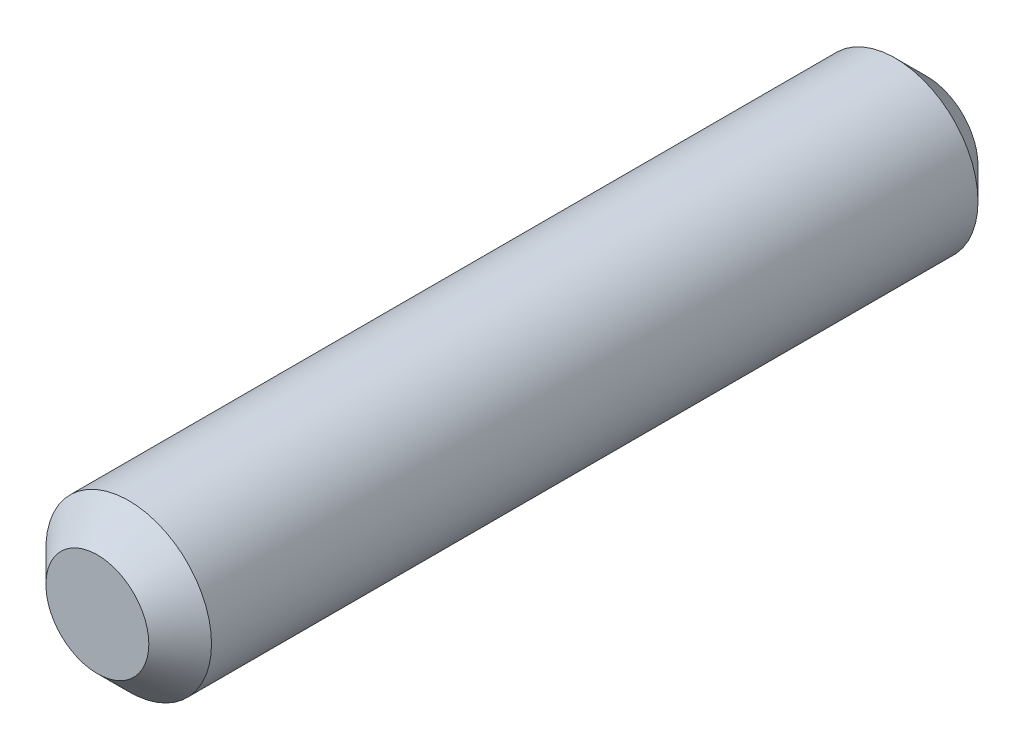
ISO-10303-21;
HEADER;
FILE_DESCRIPTION(('STEP AP214'),'2;1');
FILE_NAME('part.step','',(''),(''),'','','');
FILE_SCHEMA(('AUTOMOTIVE_DESIGN { 1 0 10303 214 1 1 1 1 }'));
ENDSEC;
DATA;
#1=APPLICATION_CONTEXT('core data for automotive mechanical design processes');
#2=APPLICATION_PROTOCOL_DEFINITION('international standard','automotive_design',2000,#1);
#3=PRODUCT_CONTEXT('',#1,'mechanical');
#4=PRODUCT('Part','Part','',(#3));
#5=PRODUCT_RELATED_PRODUCT_CATEGORY('part','',(#4));
#6=PRODUCT_DEFINITION_FORMATION('','',#4);
#7=PRODUCT_DEFINITION_CONTEXT('part definition',#1,'design');
#8=PRODUCT_DEFINITION('design','',#6,#7);
#9=PRODUCT_DEFINITION_SHAPE('','',#8);
#10=(LENGTH_UNIT() NAMED_UNIT(*) SI_UNIT(.MILLI.,.METRE.));
#11=(NAMED_UNIT(*) PLANE_ANGLE_UNIT() SI_UNIT($,.RADIAN.));
#12=(NAMED_UNIT(*) SI_UNIT($,.STERADIAN.) SOLID_ANGLE_UNIT());
#13=UNCERTAINTY_MEASURE_WITH_UNIT(LENGTH_MEASURE(1.E-05),#10,'distance_accuracy_value','');
#14=(GEOMETRIC_REPRESENTATION_CONTEXT(3) GLOBAL_UNCERTAINTY_ASSIGNED_CONTEXT((#13)) GLOBAL_UNIT_ASSIGNED_CONTEXT((#10,
#11,#12)) REPRESENTATION_CONTEXT('',''));
#15=CARTESIAN_POINT('',(0.,0.,0.));
#16=DIRECTION('',(0.,0.,1.));
#17=DIRECTION('',(1.,0.,0.));
#18=AXIS2_PLACEMENT_3D('',#15,#16,#17);
#19=CARTESIAN_POINT('',(0.,0.,7.935));
#20=DIRECTION('',(0.,0.,-1.));
#21=DIRECTION('',(-1.,0.,0.));
#22=AXIS2_PLACEMENT_3D('',#19,#20,#21);
#23=CYLINDRICAL_SURFACE('',#22,1.585);
#24=CARTESIAN_POINT('',(0.,0.,-7.335));
#25=DIRECTION('',(0.,0.,1.));
#26=DIRECTION('',(1.,0.,0.));
#27=AXIS2_PLACEMENT_3D('',#24,#25,#26);
#28=CIRCLE('',#27,1.585);
#29=CARTESIAN_POINT('',(1.585,0.,-7.335));
#30=VERTEX_POINT('',#29);
#31=EDGE_CURVE('E49',#30,#30,#28,.T.);
#32=ORIENTED_EDGE('',*,*,#31,.T.);
#33=EDGE_LOOP('',(#32));
#34=FACE_BOUND('',#33,.T.);
#35=CARTESIAN_POINT('',(0.,0.,7.335));
#36=DIRECTION('',(0.,0.,1.));
#37=DIRECTION('',(1.,0.,0.));
#38=AXIS2_PLACEMENT_3D('',#35,#36,#37);
#39=CIRCLE('',#38,1.585);
#40=CARTESIAN_POINT('',(1.585,0.,7.335));
#41=VERTEX_POINT('',#40);
#42=EDGE_CURVE('E53',#41,#41,#39,.F.);
#43=ORIENTED_EDGE('',*,*,#42,.T.);
#44=EDGE_LOOP('',(#43));
#45=FACE_BOUND('',#44,.T.);
#46=ADVANCED_FACE('F37',(#34,#45),#23,.T.);
#47=CARTESIAN_POINT('',(0.,0.,7.935));
#48=DIRECTION('',(0.,0.,1.));
#49=DIRECTION('',(1.,0.,0.));
#50=AXIS2_PLACEMENT_3D('',#47,#48,#49);
#51=PLANE('',#50);
#52=CARTESIAN_POINT('',(0.,0.,7.935));
#53=DIRECTION('',(0.,0.,1.));
#54=DIRECTION('',(1.,0.,0.));
#55=AXIS2_PLACEMENT_3D('',#52,#53,#54);
#56=CIRCLE('',#55,0.984999999999998);
#57=CARTESIAN_POINT('',(0.984999999999998,0.,7.935));
#58=VERTEX_POINT('',#57);
#59=EDGE_CURVE('E10',#58,#58,#56,.T.);
#60=ORIENTED_EDGE('',*,*,#59,.T.);
#61=EDGE_LOOP('',(#60));
#62=FACE_BOUND('',#61,.T.);
#63=ADVANCED_FACE('F69',(#62),#51,.T.);
#64=CARTESIAN_POINT('',(0.,0.,-7.935));
#65=DIRECTION('',(0.,0.,1.));
#66=DIRECTION('',(1.,0.,0.));
#67=AXIS2_PLACEMENT_3D('',#64,#65,#66);
#68=PLANE('',#67);
#69=CARTESIAN_POINT('',(0.,0.,-7.935));
#70=DIRECTION('',(0.,0.,1.));
#71=DIRECTION('',(1.,0.,0.));
#72=AXIS2_PLACEMENT_3D('',#69,#70,#71);
#73=CIRCLE('',#72,0.984999999999998);
#74=CARTESIAN_POINT('',(0.984999999999998,0.,-7.935));
#75=VERTEX_POINT('',#74);
#76=EDGE_CURVE('E45',#75,#75,#73,.F.);
#77=ORIENTED_EDGE('',*,*,#76,.T.);
#78=EDGE_LOOP('',(#77));
#79=FACE_BOUND('',#78,.T.);
#80=ADVANCED_FACE('F66',(#79),#68,.F.);
#81=CARTESIAN_POINT('',(0.,0.,-7.335));
#82=DIRECTION('',(0.,0.,1.));
#83=DIRECTION('',(1.,0.,0.));
#84=AXIS2_PLACEMENT_3D('',#81,#82,#83);
#85=CONICAL_SURFACE('',#84,1.585,0.785398163397449);
#86=ORIENTED_EDGE('',*,*,#76,.F.);
#87=EDGE_LOOP('',(#86));
#88=FACE_BOUND('',#87,.T.);
#89=ORIENTED_EDGE('',*,*,#31,.F.);
#90=EDGE_LOOP('',(#89));
#91=FACE_BOUND('',#90,.T.);
#92=ADVANCED_FACE('F62',(#88,#91),#85,.T.);
#93=CARTESIAN_POINT('',(0.,0.,7.935));
#94=DIRECTION('',(0.,0.,-1.));
#95=DIRECTION('',(-1.,0.,0.));
#96=AXIS2_PLACEMENT_3D('',#93,#94,#95);
#97=CONICAL_SURFACE('',#96,0.984999999999998,0.785398163397448);
#98=ORIENTED_EDGE('',*,*,#42,.F.);
#99=EDGE_LOOP('',(#98));
#100=FACE_BOUND('',#99,.T.);
#101=ORIENTED_EDGE('',*,*,#59,.F.);
#102=EDGE_LOOP('',(#101));
#103=FACE_BOUND('',#102,.T.);
#104=ADVANCED_FACE('F40',(#100,#103),#97,.T.);
#105=CLOSED_SHELL('',(#46,#63,#80,#92,#104));
#106=MANIFOLD_SOLID_BREP('B2',#105);
#107=ADVANCED_BREP_SHAPE_REPRESENTATION('',(#18,#106),#14);
#108=SHAPE_DEFINITION_REPRESENTATION(#9,#107);
ENDSEC;
END-ISO-10303-21;
